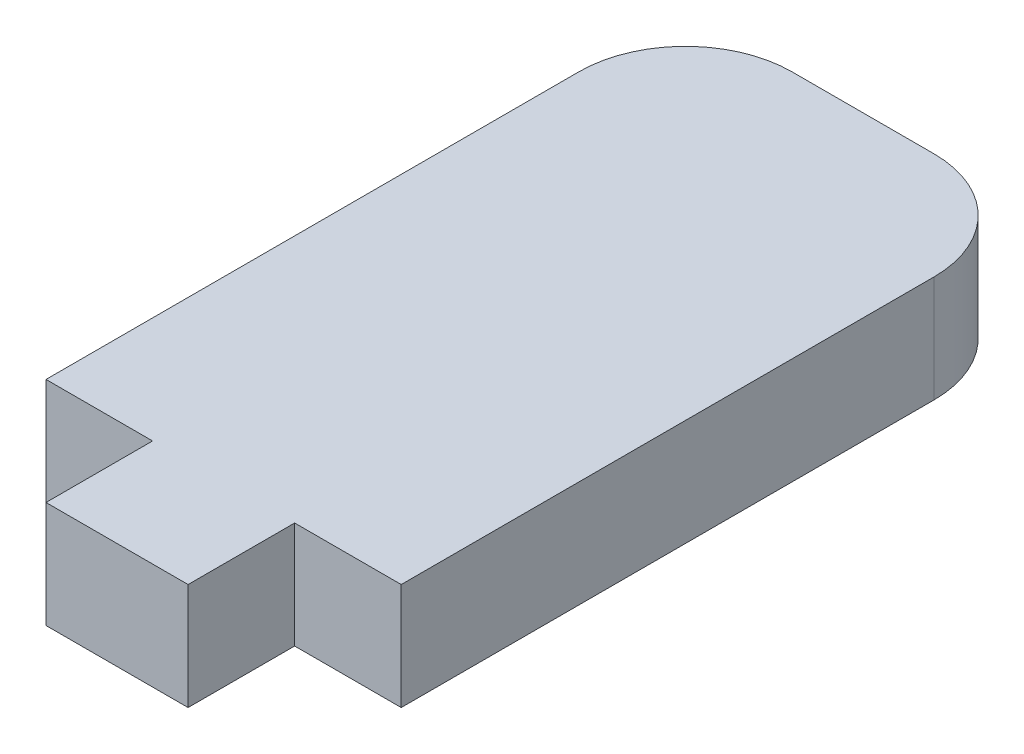
ISO-10303-21;
HEADER;
FILE_DESCRIPTION(('STEP AP214'),'2;1');
FILE_NAME('part.step','',(''),(''),'','','');
FILE_SCHEMA(('AUTOMOTIVE_DESIGN { 1 0 10303 214 1 1 1 1 }'));
ENDSEC;
DATA;
#1=APPLICATION_CONTEXT('core data for automotive mechanical design processes');
#2=APPLICATION_PROTOCOL_DEFINITION('international standard','automotive_design',2000,#1);
#3=PRODUCT_CONTEXT('',#1,'mechanical');
#4=PRODUCT('Part','Part','',(#3));
#5=PRODUCT_RELATED_PRODUCT_CATEGORY('part','',(#4));
#6=PRODUCT_DEFINITION_FORMATION('','',#4);
#7=PRODUCT_DEFINITION_CONTEXT('part definition',#1,'design');
#8=PRODUCT_DEFINITION('design','',#6,#7);
#9=PRODUCT_DEFINITION_SHAPE('','',#8);
#10=(LENGTH_UNIT() NAMED_UNIT(*) SI_UNIT(.MILLI.,.METRE.));
#11=(NAMED_UNIT(*) PLANE_ANGLE_UNIT() SI_UNIT($,.RADIAN.));
#12=(NAMED_UNIT(*) SI_UNIT($,.STERADIAN.) SOLID_ANGLE_UNIT());
#13=UNCERTAINTY_MEASURE_WITH_UNIT(LENGTH_MEASURE(1.E-05),#10,'distance_accuracy_value','');
#14=(GEOMETRIC_REPRESENTATION_CONTEXT(3) GLOBAL_UNCERTAINTY_ASSIGNED_CONTEXT((#13)) GLOBAL_UNIT_ASSIGNED_CONTEXT((#10,
#11,#12)) REPRESENTATION_CONTEXT('',''));
#15=CARTESIAN_POINT('',(0.,0.,0.));
#16=DIRECTION('',(0.,0.,1.));
#17=DIRECTION('',(1.,0.,0.));
#18=AXIS2_PLACEMENT_3D('',#15,#16,#17);
#19=CARTESIAN_POINT('',(-5.,1.5,7.5));
#20=DIRECTION('',(0.,0.,-1.));
#21=DIRECTION('',(-1.,0.,0.));
#22=AXIS2_PLACEMENT_3D('',#19,#20,#21);
#23=PLANE('',#22);
#24=DIRECTION('',(0.,-1.,0.));
#25=VECTOR('',#24,1.);
#26=CARTESIAN_POINT('',(-2.,1.5,7.5));
#27=LINE('',#26,#25);
#28=CARTESIAN_POINT('',(-2.,1.5,7.5));
#29=VERTEX_POINT('',#28);
#30=CARTESIAN_POINT('',(-2.,-1.5,7.5));
#31=VERTEX_POINT('',#30);
#32=EDGE_CURVE('E166',#29,#31,#27,.T.);
#33=ORIENTED_EDGE('',*,*,#32,.F.);
#34=DIRECTION('',(1.,0.,0.));
#35=VECTOR('',#34,1.);
#36=CARTESIAN_POINT('',(-5.,1.5,7.5));
#37=LINE('',#36,#35);
#38=CARTESIAN_POINT('',(-5.,1.5,7.5));
#39=VERTEX_POINT('',#38);
#40=EDGE_CURVE('E132',#39,#29,#37,.T.);
#41=ORIENTED_EDGE('',*,*,#40,.F.);
#42=DIRECTION('',(0.,-1.,0.));
#43=VECTOR('',#42,1.);
#44=CARTESIAN_POINT('',(-5.,1.5,7.5));
#45=LINE('',#44,#43);
#46=CARTESIAN_POINT('',(-5.,-1.5,7.5));
#47=VERTEX_POINT('',#46);
#48=EDGE_CURVE('E126',#39,#47,#45,.T.);
#49=ORIENTED_EDGE('',*,*,#48,.T.);
#50=DIRECTION('',(1.,0.,0.));
#51=VECTOR('',#50,1.);
#52=CARTESIAN_POINT('',(-5.,-1.5,7.5));
#53=LINE('',#52,#51);
#54=EDGE_CURVE('E148',#47,#31,#53,.T.);
#55=ORIENTED_EDGE('',*,*,#54,.T.);
#56=EDGE_LOOP('',(#33,#41,#49,#55));
#57=FACE_BOUND('',#56,.T.);
#58=ADVANCED_FACE('F36',(#57),#23,.F.);
#59=CARTESIAN_POINT('',(5.,1.5,-7.5));
#60=DIRECTION('',(-1.,0.,0.));
#61=DIRECTION('',(0.,0.,1.));
#62=AXIS2_PLACEMENT_3D('',#59,#60,#61);
#63=PLANE('',#62);
#64=DIRECTION('',(0.,0.,-1.));
#65=VECTOR('',#64,1.);
#66=CARTESIAN_POINT('',(5.,-1.5,-7.5));
#67=LINE('',#66,#65);
#68=CARTESIAN_POINT('',(5.,-1.5,7.5));
#69=VERTEX_POINT('',#68);
#70=CARTESIAN_POINT('',(5.,-1.5,-7.5));
#71=VERTEX_POINT('',#70);
#72=EDGE_CURVE('E137',#69,#71,#67,.T.);
#73=ORIENTED_EDGE('',*,*,#72,.T.);
#74=DIRECTION('',(0.,-1.,0.));
#75=VECTOR('',#74,1.);
#76=CARTESIAN_POINT('',(5.,1.5,-7.5));
#77=LINE('',#76,#75);
#78=CARTESIAN_POINT('',(5.,1.5,-7.5));
#79=VERTEX_POINT('',#78);
#80=EDGE_CURVE('E11',#79,#71,#77,.T.);
#81=ORIENTED_EDGE('',*,*,#80,.F.);
#82=DIRECTION('',(0.,0.,-1.));
#83=VECTOR('',#82,1.);
#84=CARTESIAN_POINT('',(5.,1.5,-7.5));
#85=LINE('',#84,#83);
#86=CARTESIAN_POINT('',(5.,1.5,7.5));
#87=VERTEX_POINT('',#86);
#88=EDGE_CURVE('E151',#87,#79,#85,.T.);
#89=ORIENTED_EDGE('',*,*,#88,.F.);
#90=DIRECTION('',(0.,-1.,0.));
#91=VECTOR('',#90,1.);
#92=CARTESIAN_POINT('',(5.,1.5,7.5));
#93=LINE('',#92,#91);
#94=EDGE_CURVE('E136',#87,#69,#93,.T.);
#95=ORIENTED_EDGE('',*,*,#94,.T.);
#96=EDGE_LOOP('',(#73,#81,#89,#95));
#97=FACE_BOUND('',#96,.T.);
#98=ADVANCED_FACE('F38',(#97),#63,.F.);
#99=CARTESIAN_POINT('',(2.,1.5,-7.5));
#100=DIRECTION('',(0.,-1.,0.));
#101=DIRECTION('',(0.,0.,-1.));
#102=AXIS2_PLACEMENT_3D('',#99,#100,#101);
#103=CYLINDRICAL_SURFACE('',#102,3.);
#104=CARTESIAN_POINT('',(2.,-1.5,-7.5));
#105=DIRECTION('',(0.,1.,0.));
#106=DIRECTION('',(0.,0.,-1.));
#107=AXIS2_PLACEMENT_3D('',#104,#105,#106);
#108=CIRCLE('',#107,3.);
#109=CARTESIAN_POINT('',(2.,-1.5,-10.5));
#110=VERTEX_POINT('',#109);
#111=EDGE_CURVE('E140',#71,#110,#108,.T.);
#112=ORIENTED_EDGE('',*,*,#111,.T.);
#113=DIRECTION('',(0.,-1.,0.));
#114=VECTOR('',#113,1.);
#115=CARTESIAN_POINT('',(2.,1.5,-10.5));
#116=LINE('',#115,#114);
#117=CARTESIAN_POINT('',(2.,1.5,-10.5));
#118=VERTEX_POINT('',#117);
#119=EDGE_CURVE('E44',#118,#110,#116,.T.);
#120=ORIENTED_EDGE('',*,*,#119,.F.);
#121=CARTESIAN_POINT('',(2.,1.5,-7.5));
#122=DIRECTION('',(0.,1.,0.));
#123=DIRECTION('',(0.,0.,-1.));
#124=AXIS2_PLACEMENT_3D('',#121,#122,#123);
#125=CIRCLE('',#124,3.);
#126=EDGE_CURVE('E95',#79,#118,#125,.T.);
#127=ORIENTED_EDGE('',*,*,#126,.F.);
#128=ORIENTED_EDGE('',*,*,#80,.T.);
#129=EDGE_LOOP('',(#112,#120,#127,#128));
#130=FACE_BOUND('',#129,.T.);
#131=ADVANCED_FACE('F214',(#130),#103,.T.);
#132=CARTESIAN_POINT('',(-2.,1.5,-10.5));
#133=DIRECTION('',(0.,0.,1.));
#134=DIRECTION('',(1.,0.,0.));
#135=AXIS2_PLACEMENT_3D('',#132,#133,#134);
#136=PLANE('',#135);
#137=DIRECTION('',(-1.,0.,0.));
#138=VECTOR('',#137,1.);
#139=CARTESIAN_POINT('',(-2.,-1.5,-10.5));
#140=LINE('',#139,#138);
#141=CARTESIAN_POINT('',(-2.,-1.5,-10.5));
#142=VERTEX_POINT('',#141);
#143=EDGE_CURVE('E143',#110,#142,#140,.T.);
#144=ORIENTED_EDGE('',*,*,#143,.T.);
#145=DIRECTION('',(0.,-1.,0.));
#146=VECTOR('',#145,1.);
#147=CARTESIAN_POINT('',(-2.,1.5,-10.5));
#148=LINE('',#147,#146);
#149=CARTESIAN_POINT('',(-2.,1.5,-10.5));
#150=VERTEX_POINT('',#149);
#151=EDGE_CURVE('E125',#150,#142,#148,.T.);
#152=ORIENTED_EDGE('',*,*,#151,.F.);
#153=DIRECTION('',(-1.,0.,0.));
#154=VECTOR('',#153,1.);
#155=CARTESIAN_POINT('',(-2.,1.5,-10.5));
#156=LINE('',#155,#154);
#157=EDGE_CURVE('E113',#118,#150,#156,.T.);
#158=ORIENTED_EDGE('',*,*,#157,.F.);
#159=ORIENTED_EDGE('',*,*,#119,.T.);
#160=EDGE_LOOP('',(#144,#152,#158,#159));
#161=FACE_BOUND('',#160,.T.);
#162=ADVANCED_FACE('F157',(#161),#136,.F.);
#163=CARTESIAN_POINT('',(-2.,1.5,-7.5));
#164=DIRECTION('',(0.,-1.,0.));
#165=DIRECTION('',(0.,0.,-1.));
#166=AXIS2_PLACEMENT_3D('',#163,#164,#165);
#167=CYLINDRICAL_SURFACE('',#166,3.);
#168=CARTESIAN_POINT('',(-2.,-1.5,-7.5));
#169=DIRECTION('',(0.,1.,0.));
#170=DIRECTION('',(0.,0.,1.));
#171=AXIS2_PLACEMENT_3D('',#168,#169,#170);
#172=CIRCLE('',#171,3.);
#173=CARTESIAN_POINT('',(-5.,-1.5,-7.5));
#174=VERTEX_POINT('',#173);
#175=EDGE_CURVE('E122',#142,#174,#172,.T.);
#176=ORIENTED_EDGE('',*,*,#175,.T.);
#177=DIRECTION('',(0.,-1.,0.));
#178=VECTOR('',#177,1.);
#179=CARTESIAN_POINT('',(-5.,1.5,-7.5));
#180=LINE('',#179,#178);
#181=CARTESIAN_POINT('',(-5.,1.5,-7.5));
#182=VERTEX_POINT('',#181);
#183=EDGE_CURVE('E119',#182,#174,#180,.T.);
#184=ORIENTED_EDGE('',*,*,#183,.F.);
#185=CARTESIAN_POINT('',(-2.,1.5,-7.5));
#186=DIRECTION('',(0.,1.,0.));
#187=DIRECTION('',(0.,0.,1.));
#188=AXIS2_PLACEMENT_3D('',#185,#186,#187);
#189=CIRCLE('',#188,3.);
#190=EDGE_CURVE('E105',#150,#182,#189,.T.);
#191=ORIENTED_EDGE('',*,*,#190,.F.);
#192=ORIENTED_EDGE('',*,*,#151,.T.);
#193=EDGE_LOOP('',(#176,#184,#191,#192));
#194=FACE_BOUND('',#193,.T.);
#195=ADVANCED_FACE('F120',(#194),#167,.T.);
#196=CARTESIAN_POINT('',(-5.,1.5,-7.5));
#197=DIRECTION('',(1.,0.,0.));
#198=DIRECTION('',(0.,0.,-1.));
#199=AXIS2_PLACEMENT_3D('',#196,#197,#198);
#200=PLANE('',#199);
#201=DIRECTION('',(0.,0.,1.));
#202=VECTOR('',#201,1.);
#203=CARTESIAN_POINT('',(-5.,-1.5,-7.5));
#204=LINE('',#203,#202);
#205=EDGE_CURVE('E146',#174,#47,#204,.T.);
#206=ORIENTED_EDGE('',*,*,#205,.T.);
#207=ORIENTED_EDGE('',*,*,#48,.F.);
#208=DIRECTION('',(0.,0.,1.));
#209=VECTOR('',#208,1.);
#210=CARTESIAN_POINT('',(-5.,1.5,-7.5));
#211=LINE('',#210,#209);
#212=EDGE_CURVE('E110',#182,#39,#211,.T.);
#213=ORIENTED_EDGE('',*,*,#212,.F.);
#214=ORIENTED_EDGE('',*,*,#183,.T.);
#215=EDGE_LOOP('',(#206,#207,#213,#214));
#216=FACE_BOUND('',#215,.T.);
#217=ADVANCED_FACE('F128',(#216),#200,.F.);
#218=CARTESIAN_POINT('',(2.,1.5,7.5));
#219=VERTEX_POINT('',#218);
#220=EDGE_CURVE('E60',#219,#87,#37,.T.);
#221=ORIENTED_EDGE('',*,*,#220,.F.);
#222=DIRECTION('',(0.,-1.,0.));
#223=VECTOR('',#222,1.);
#224=CARTESIAN_POINT('',(2.,1.5,7.5));
#225=LINE('',#224,#223);
#226=CARTESIAN_POINT('',(2.,-1.5,7.5));
#227=VERTEX_POINT('',#226);
#228=EDGE_CURVE('E197',#219,#227,#225,.T.);
#229=ORIENTED_EDGE('',*,*,#228,.T.);
#230=EDGE_CURVE('E87',#227,#69,#53,.T.);
#231=ORIENTED_EDGE('',*,*,#230,.T.);
#232=ORIENTED_EDGE('',*,*,#94,.F.);
#233=EDGE_LOOP('',(#221,#229,#231,#232));
#234=FACE_BOUND('',#233,.T.);
#235=ADVANCED_FACE('F223',(#234),#23,.F.);
#236=CARTESIAN_POINT('',(-2.,1.5,-7.5));
#237=DIRECTION('',(0.,1.,0.));
#238=DIRECTION('',(0.,0.,1.));
#239=AXIS2_PLACEMENT_3D('',#236,#237,#238);
#240=PLANE('',#239);
#241=ORIENTED_EDGE('',*,*,#88,.T.);
#242=ORIENTED_EDGE('',*,*,#126,.T.);
#243=ORIENTED_EDGE('',*,*,#157,.T.);
#244=ORIENTED_EDGE('',*,*,#190,.T.);
#245=ORIENTED_EDGE('',*,*,#212,.T.);
#246=ORIENTED_EDGE('',*,*,#40,.T.);
#247=DIRECTION('',(0.,0.,1.));
#248=VECTOR('',#247,1.);
#249=CARTESIAN_POINT('',(-2.,1.5,7.5));
#250=LINE('',#249,#248);
#251=CARTESIAN_POINT('',(-2.,1.5,10.5));
#252=VERTEX_POINT('',#251);
#253=EDGE_CURVE('E171',#29,#252,#250,.T.);
#254=ORIENTED_EDGE('',*,*,#253,.T.);
#255=DIRECTION('',(1.,0.,0.));
#256=VECTOR('',#255,1.);
#257=CARTESIAN_POINT('',(-2.,1.5,10.5));
#258=LINE('',#257,#256);
#259=CARTESIAN_POINT('',(2.,1.5,10.5));
#260=VERTEX_POINT('',#259);
#261=EDGE_CURVE('E191',#252,#260,#258,.T.);
#262=ORIENTED_EDGE('',*,*,#261,.T.);
#263=DIRECTION('',(0.,0.,-1.));
#264=VECTOR('',#263,1.);
#265=CARTESIAN_POINT('',(2.,1.5,7.5));
#266=LINE('',#265,#264);
#267=EDGE_CURVE('E193',#260,#219,#266,.T.);
#268=ORIENTED_EDGE('',*,*,#267,.T.);
#269=ORIENTED_EDGE('',*,*,#220,.T.);
#270=EDGE_LOOP('',(#241,#242,#243,#244,#245,#246,#254,#262,#268,#269));
#271=FACE_BOUND('',#270,.T.);
#272=ADVANCED_FACE('F107',(#271),#240,.T.);
#273=CARTESIAN_POINT('',(-2.,-1.5,-7.5));
#274=DIRECTION('',(0.,1.,0.));
#275=DIRECTION('',(0.,0.,1.));
#276=AXIS2_PLACEMENT_3D('',#273,#274,#275);
#277=PLANE('',#276);
#278=ORIENTED_EDGE('',*,*,#72,.F.);
#279=ORIENTED_EDGE('',*,*,#230,.F.);
#280=DIRECTION('',(0.,0.,-1.));
#281=VECTOR('',#280,1.);
#282=CARTESIAN_POINT('',(2.,-1.5,7.5));
#283=LINE('',#282,#281);
#284=CARTESIAN_POINT('',(2.,-1.5,10.5));
#285=VERTEX_POINT('',#284);
#286=EDGE_CURVE('E51',#285,#227,#283,.T.);
#287=ORIENTED_EDGE('',*,*,#286,.F.);
#288=DIRECTION('',(1.,0.,0.));
#289=VECTOR('',#288,1.);
#290=CARTESIAN_POINT('',(-2.,-1.5,10.5));
#291=LINE('',#290,#289);
#292=CARTESIAN_POINT('',(-2.,-1.5,10.5));
#293=VERTEX_POINT('',#292);
#294=EDGE_CURVE('E187',#293,#285,#291,.T.);
#295=ORIENTED_EDGE('',*,*,#294,.F.);
#296=DIRECTION('',(0.,0.,1.));
#297=VECTOR('',#296,1.);
#298=CARTESIAN_POINT('',(-2.,-1.5,7.5));
#299=LINE('',#298,#297);
#300=EDGE_CURVE('E204',#31,#293,#299,.T.);
#301=ORIENTED_EDGE('',*,*,#300,.F.);
#302=ORIENTED_EDGE('',*,*,#54,.F.);
#303=ORIENTED_EDGE('',*,*,#205,.F.);
#304=ORIENTED_EDGE('',*,*,#175,.F.);
#305=ORIENTED_EDGE('',*,*,#143,.F.);
#306=ORIENTED_EDGE('',*,*,#111,.F.);
#307=EDGE_LOOP('',(#278,#279,#287,#295,#301,#302,#303,#304,#305,#306));
#308=FACE_BOUND('',#307,.T.);
#309=ADVANCED_FACE('F160',(#308),#277,.F.);
#310=CARTESIAN_POINT('',(-2.,1.5,7.5));
#311=DIRECTION('',(1.,0.,0.));
#312=DIRECTION('',(0.,0.,-1.));
#313=AXIS2_PLACEMENT_3D('',#310,#311,#312);
#314=PLANE('',#313);
#315=ORIENTED_EDGE('',*,*,#300,.T.);
#316=DIRECTION('',(0.,-1.,0.));
#317=VECTOR('',#316,1.);
#318=CARTESIAN_POINT('',(-2.,1.5,10.5));
#319=LINE('',#318,#317);
#320=EDGE_CURVE('E141',#252,#293,#319,.T.);
#321=ORIENTED_EDGE('',*,*,#320,.F.);
#322=ORIENTED_EDGE('',*,*,#253,.F.);
#323=ORIENTED_EDGE('',*,*,#32,.T.);
#324=EDGE_LOOP('',(#315,#321,#322,#323));
#325=FACE_BOUND('',#324,.T.);
#326=ADVANCED_FACE('F234',(#325),#314,.F.);
#327=CARTESIAN_POINT('',(-2.,1.5,10.5));
#328=DIRECTION('',(0.,0.,-1.));
#329=DIRECTION('',(-1.,0.,0.));
#330=AXIS2_PLACEMENT_3D('',#327,#328,#329);
#331=PLANE('',#330);
#332=ORIENTED_EDGE('',*,*,#294,.T.);
#333=DIRECTION('',(0.,-1.,0.));
#334=VECTOR('',#333,1.);
#335=CARTESIAN_POINT('',(2.,1.5,10.5));
#336=LINE('',#335,#334);
#337=EDGE_CURVE('E195',#260,#285,#336,.T.);
#338=ORIENTED_EDGE('',*,*,#337,.F.);
#339=ORIENTED_EDGE('',*,*,#261,.F.);
#340=ORIENTED_EDGE('',*,*,#320,.T.);
#341=EDGE_LOOP('',(#332,#338,#339,#340));
#342=FACE_BOUND('',#341,.T.);
#343=ADVANCED_FACE('F196',(#342),#331,.F.);
#344=CARTESIAN_POINT('',(2.,1.5,7.5));
#345=DIRECTION('',(-1.,0.,0.));
#346=DIRECTION('',(0.,0.,1.));
#347=AXIS2_PLACEMENT_3D('',#344,#345,#346);
#348=PLANE('',#347);
#349=ORIENTED_EDGE('',*,*,#286,.T.);
#350=ORIENTED_EDGE('',*,*,#228,.F.);
#351=ORIENTED_EDGE('',*,*,#267,.F.);
#352=ORIENTED_EDGE('',*,*,#337,.T.);
#353=EDGE_LOOP('',(#349,#350,#351,#352));
#354=FACE_BOUND('',#353,.T.);
#355=ADVANCED_FACE('F199',(#354),#348,.F.);
#356=CLOSED_SHELL('',(#58,#98,#131,#162,#195,#217,#235,#272,#309,#326,#343,#355));
#357=MANIFOLD_SOLID_BREP('B2',#356);
#358=ADVANCED_BREP_SHAPE_REPRESENTATION('',(#18,#357),#14);
#359=SHAPE_DEFINITION_REPRESENTATION(#9,#358);
ENDSEC;
END-ISO-10303-21;
